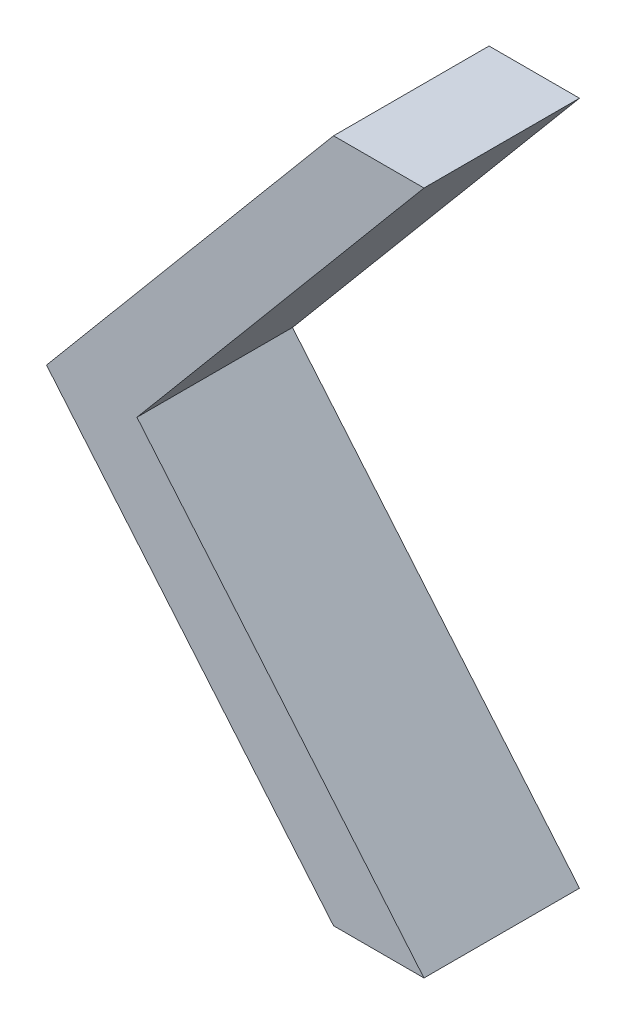
ISO-10303-21;
HEADER;
FILE_DESCRIPTION(('STEP AP214'),'2;1');
FILE_NAME('part.step','',(''),(''),'','','');
FILE_SCHEMA(('AUTOMOTIVE_DESIGN { 1 0 10303 214 1 1 1 1 }'));
ENDSEC;
DATA;
#1=APPLICATION_CONTEXT('core data for automotive mechanical design processes');
#2=APPLICATION_PROTOCOL_DEFINITION('international standard','automotive_design',2000,#1);
#3=PRODUCT_CONTEXT('',#1,'mechanical');
#4=PRODUCT('Part','Part','',(#3));
#5=PRODUCT_RELATED_PRODUCT_CATEGORY('part','',(#4));
#6=PRODUCT_DEFINITION_FORMATION('','',#4);
#7=PRODUCT_DEFINITION_CONTEXT('part definition',#1,'design');
#8=PRODUCT_DEFINITION('design','',#6,#7);
#9=PRODUCT_DEFINITION_SHAPE('','',#8);
#10=(LENGTH_UNIT() NAMED_UNIT(*) SI_UNIT(.MILLI.,.METRE.));
#11=(NAMED_UNIT(*) PLANE_ANGLE_UNIT() SI_UNIT($,.RADIAN.));
#12=(NAMED_UNIT(*) SI_UNIT($,.STERADIAN.) SOLID_ANGLE_UNIT());
#13=UNCERTAINTY_MEASURE_WITH_UNIT(LENGTH_MEASURE(1.E-05),#10,'distance_accuracy_value','');
#14=(GEOMETRIC_REPRESENTATION_CONTEXT(3) GLOBAL_UNCERTAINTY_ASSIGNED_CONTEXT((#13)) GLOBAL_UNIT_ASSIGNED_CONTEXT((#10,
#11,#12)) REPRESENTATION_CONTEXT('',''));
#15=CARTESIAN_POINT('',(0.,0.,0.));
#16=DIRECTION('',(0.,0.,1.));
#17=DIRECTION('',(1.,0.,0.));
#18=AXIS2_PLACEMENT_3D('',#15,#16,#17);
#19=CARTESIAN_POINT('',(0.,0.,12.5));
#20=DIRECTION('',(0.,-1.,0.));
#21=DIRECTION('',(0.,0.,-1.));
#22=AXIS2_PLACEMENT_3D('',#19,#20,#21);
#23=PLANE('',#22);
#24=DIRECTION('',(-1.,0.,0.));
#25=VECTOR('',#24,1.);
#26=CARTESIAN_POINT('',(0.,0.,0.));
#27=LINE('',#26,#25);
#28=CARTESIAN_POINT('',(7.27,0.,0.));
#29=VERTEX_POINT('',#28);
#30=CARTESIAN_POINT('',(0.,0.,0.));
#31=VERTEX_POINT('',#30);
#32=EDGE_CURVE('E128',#29,#31,#27,.T.);
#33=ORIENTED_EDGE('',*,*,#32,.T.);
#34=DIRECTION('',(0.,0.,-1.));
#35=VECTOR('',#34,1.);
#36=CARTESIAN_POINT('',(0.,0.,12.5));
#37=LINE('',#36,#35);
#38=CARTESIAN_POINT('',(0.,0.,12.5));
#39=VERTEX_POINT('',#38);
#40=EDGE_CURVE('E11',#39,#31,#37,.T.);
#41=ORIENTED_EDGE('',*,*,#40,.F.);
#42=DIRECTION('',(-1.,0.,0.));
#43=VECTOR('',#42,1.);
#44=CARTESIAN_POINT('',(0.,0.,12.5));
#45=LINE('',#44,#43);
#46=CARTESIAN_POINT('',(7.27,0.,12.5));
#47=VERTEX_POINT('',#46);
#48=EDGE_CURVE('E144',#47,#39,#45,.T.);
#49=ORIENTED_EDGE('',*,*,#48,.F.);
#50=DIRECTION('',(0.,0.,-1.));
#51=VECTOR('',#50,1.);
#52=CARTESIAN_POINT('',(7.27,0.,12.5));
#53=LINE('',#52,#51);
#54=EDGE_CURVE('E124',#47,#29,#53,.T.);
#55=ORIENTED_EDGE('',*,*,#54,.T.);
#56=EDGE_LOOP('',(#33,#41,#49,#55));
#57=FACE_BOUND('',#56,.T.);
#58=ADVANCED_FACE('F39',(#57),#23,.F.);
#59=CARTESIAN_POINT('',(0.,0.,12.5));
#60=DIRECTION('',(0.766044443118977,-0.642787609686541,0.));
#61=DIRECTION('',(0.642787609686541,0.766044443118977,0.));
#62=AXIS2_PLACEMENT_3D('',#59,#60,#61);
#63=PLANE('',#62);
#64=DIRECTION('',(-0.642787609686541,-0.766044443118977,0.));
#65=VECTOR('',#64,1.);
#66=CARTESIAN_POINT('',(0.,0.,0.));
#67=LINE('',#66,#65);
#68=CARTESIAN_POINT('',(-23.0752398573753,-27.5,0.));
#69=VERTEX_POINT('',#68);
#70=EDGE_CURVE('E132',#31,#69,#67,.T.);
#71=ORIENTED_EDGE('',*,*,#70,.T.);
#72=DIRECTION('',(0.,0.,-1.));
#73=VECTOR('',#72,1.);
#74=CARTESIAN_POINT('',(-23.0752398573753,-27.5,12.5));
#75=LINE('',#74,#73);
#76=CARTESIAN_POINT('',(-23.0752398573753,-27.5,12.5));
#77=VERTEX_POINT('',#76);
#78=EDGE_CURVE('E48',#77,#69,#75,.T.);
#79=ORIENTED_EDGE('',*,*,#78,.F.);
#80=DIRECTION('',(-0.642787609686541,-0.766044443118977,0.));
#81=VECTOR('',#80,1.);
#82=CARTESIAN_POINT('',(0.,0.,12.5));
#83=LINE('',#82,#81);
#84=EDGE_CURVE('E93',#39,#77,#83,.T.);
#85=ORIENTED_EDGE('',*,*,#84,.F.);
#86=ORIENTED_EDGE('',*,*,#40,.T.);
#87=EDGE_LOOP('',(#71,#79,#85,#86));
#88=FACE_BOUND('',#87,.T.);
#89=ADVANCED_FACE('F172',(#88),#63,.F.);
#90=CARTESIAN_POINT('',(-23.0752398573753,-27.5,12.5));
#91=DIRECTION('',(0.766044443118977,0.64278760968654,0.));
#92=DIRECTION('',(-0.64278760968654,0.766044443118977,0.));
#93=AXIS2_PLACEMENT_3D('',#90,#91,#92);
#94=PLANE('',#93);
#95=DIRECTION('',(0.64278760968654,-0.766044443118977,0.));
#96=VECTOR('',#95,1.);
#97=CARTESIAN_POINT('',(-23.0752398573753,-27.5,0.));
#98=LINE('',#97,#96);
#99=CARTESIAN_POINT('',(0.,-55.,0.));
#100=VERTEX_POINT('',#99);
#101=EDGE_CURVE('E135',#69,#100,#98,.T.);
#102=ORIENTED_EDGE('',*,*,#101,.T.);
#103=DIRECTION('',(0.,0.,-1.));
#104=VECTOR('',#103,1.);
#105=CARTESIAN_POINT('',(0.,-55.,12.5));
#106=LINE('',#105,#104);
#107=CARTESIAN_POINT('',(0.,-55.,12.5));
#108=VERTEX_POINT('',#107);
#109=EDGE_CURVE('E117',#108,#100,#106,.T.);
#110=ORIENTED_EDGE('',*,*,#109,.F.);
#111=DIRECTION('',(0.64278760968654,-0.766044443118977,0.));
#112=VECTOR('',#111,1.);
#113=CARTESIAN_POINT('',(-23.0752398573753,-27.5,12.5));
#114=LINE('',#113,#112);
#115=EDGE_CURVE('E106',#77,#108,#114,.T.);
#116=ORIENTED_EDGE('',*,*,#115,.F.);
#117=ORIENTED_EDGE('',*,*,#78,.T.);
#118=EDGE_LOOP('',(#102,#110,#116,#117));
#119=FACE_BOUND('',#118,.T.);
#120=ADVANCED_FACE('F154',(#119),#94,.F.);
#121=CARTESIAN_POINT('',(0.,-55.,12.5));
#122=DIRECTION('',(0.,1.,0.));
#123=DIRECTION('',(0.,0.,1.));
#124=AXIS2_PLACEMENT_3D('',#121,#122,#123);
#125=PLANE('',#124);
#126=DIRECTION('',(1.,0.,0.));
#127=VECTOR('',#126,1.);
#128=CARTESIAN_POINT('',(0.,-55.,0.));
#129=LINE('',#128,#127);
#130=CARTESIAN_POINT('',(7.26999999999999,-55.,0.));
#131=VERTEX_POINT('',#130);
#132=EDGE_CURVE('E115',#100,#131,#129,.T.);
#133=ORIENTED_EDGE('',*,*,#132,.T.);
#134=DIRECTION('',(0.,0.,-1.));
#135=VECTOR('',#134,1.);
#136=CARTESIAN_POINT('',(7.26999999999999,-55.,12.5));
#137=LINE('',#136,#135);
#138=CARTESIAN_POINT('',(7.26999999999999,-55.,12.5));
#139=VERTEX_POINT('',#138);
#140=EDGE_CURVE('E112',#139,#131,#137,.T.);
#141=ORIENTED_EDGE('',*,*,#140,.F.);
#142=DIRECTION('',(1.,0.,0.));
#143=VECTOR('',#142,1.);
#144=CARTESIAN_POINT('',(0.,-55.,12.5));
#145=LINE('',#144,#143);
#146=EDGE_CURVE('E100',#108,#139,#145,.T.);
#147=ORIENTED_EDGE('',*,*,#146,.F.);
#148=ORIENTED_EDGE('',*,*,#109,.T.);
#149=EDGE_LOOP('',(#133,#141,#147,#148));
#150=FACE_BOUND('',#149,.T.);
#151=ADVANCED_FACE('F113',(#150),#125,.F.);
#152=CARTESIAN_POINT('',(-15.8052398573753,-27.5,12.5));
#153=DIRECTION('',(-0.766044443118977,-0.64278760968654,0.));
#154=DIRECTION('',(0.64278760968654,-0.766044443118977,0.));
#155=AXIS2_PLACEMENT_3D('',#152,#153,#154);
#156=PLANE('',#155);
#157=DIRECTION('',(-0.64278760968654,0.766044443118977,0.));
#158=VECTOR('',#157,1.);
#159=CARTESIAN_POINT('',(-15.8052398573753,-27.5,0.));
#160=LINE('',#159,#158);
#161=CARTESIAN_POINT('',(-15.8052398573753,-27.5,0.));
#162=VERTEX_POINT('',#161);
#163=EDGE_CURVE('E79',#131,#162,#160,.T.);
#164=ORIENTED_EDGE('',*,*,#163,.T.);
#165=DIRECTION('',(0.,0.,-1.));
#166=VECTOR('',#165,1.);
#167=CARTESIAN_POINT('',(-15.8052398573753,-27.5,12.5));
#168=LINE('',#167,#166);
#169=CARTESIAN_POINT('',(-15.8052398573753,-27.5,12.5));
#170=VERTEX_POINT('',#169);
#171=EDGE_CURVE('E118',#170,#162,#168,.T.);
#172=ORIENTED_EDGE('',*,*,#171,.F.);
#173=DIRECTION('',(-0.64278760968654,0.766044443118977,0.));
#174=VECTOR('',#173,1.);
#175=CARTESIAN_POINT('',(-15.8052398573753,-27.5,12.5));
#176=LINE('',#175,#174);
#177=EDGE_CURVE('E104',#139,#170,#176,.T.);
#178=ORIENTED_EDGE('',*,*,#177,.F.);
#179=ORIENTED_EDGE('',*,*,#140,.T.);
#180=EDGE_LOOP('',(#164,#172,#178,#179));
#181=FACE_BOUND('',#180,.T.);
#182=ADVANCED_FACE('F120',(#181),#156,.F.);
#183=CARTESIAN_POINT('',(7.27,0.,12.5));
#184=DIRECTION('',(-0.766044443118977,0.642787609686541,0.));
#185=DIRECTION('',(-0.642787609686541,-0.766044443118977,0.));
#186=AXIS2_PLACEMENT_3D('',#183,#184,#185);
#187=PLANE('',#186);
#188=DIRECTION('',(0.642787609686541,0.766044443118977,0.));
#189=VECTOR('',#188,1.);
#190=CARTESIAN_POINT('',(7.27,0.,0.));
#191=LINE('',#190,#189);
#192=EDGE_CURVE('E85',#162,#29,#191,.T.);
#193=ORIENTED_EDGE('',*,*,#192,.T.);
#194=ORIENTED_EDGE('',*,*,#54,.F.);
#195=DIRECTION('',(0.642787609686541,0.766044443118977,0.));
#196=VECTOR('',#195,1.);
#197=CARTESIAN_POINT('',(7.27,0.,12.5));
#198=LINE('',#197,#196);
#199=EDGE_CURVE('E56',#170,#47,#198,.T.);
#200=ORIENTED_EDGE('',*,*,#199,.F.);
#201=ORIENTED_EDGE('',*,*,#171,.T.);
#202=EDGE_LOOP('',(#193,#194,#200,#201));
#203=FACE_BOUND('',#202,.T.);
#204=ADVANCED_FACE('F161',(#203),#187,.F.);
#205=CARTESIAN_POINT('',(0.,0.,12.5));
#206=DIRECTION('',(0.,0.,-1.));
#207=DIRECTION('',(-1.,0.,0.));
#208=AXIS2_PLACEMENT_3D('',#205,#206,#207);
#209=PLANE('',#208);
#210=ORIENTED_EDGE('',*,*,#48,.T.);
#211=ORIENTED_EDGE('',*,*,#84,.T.);
#212=ORIENTED_EDGE('',*,*,#115,.T.);
#213=ORIENTED_EDGE('',*,*,#146,.T.);
#214=ORIENTED_EDGE('',*,*,#177,.T.);
#215=ORIENTED_EDGE('',*,*,#199,.T.);
#216=EDGE_LOOP('',(#210,#211,#212,#213,#214,#215));
#217=FACE_BOUND('',#216,.T.);
#218=ADVANCED_FACE('F102',(#217),#209,.F.);
#219=CARTESIAN_POINT('',(0.,0.,0.));
#220=DIRECTION('',(0.,0.,-1.));
#221=DIRECTION('',(-1.,0.,0.));
#222=AXIS2_PLACEMENT_3D('',#219,#220,#221);
#223=PLANE('',#222);
#224=ORIENTED_EDGE('',*,*,#32,.F.);
#225=ORIENTED_EDGE('',*,*,#192,.F.);
#226=ORIENTED_EDGE('',*,*,#163,.F.);
#227=ORIENTED_EDGE('',*,*,#132,.F.);
#228=ORIENTED_EDGE('',*,*,#101,.F.);
#229=ORIENTED_EDGE('',*,*,#70,.F.);
#230=EDGE_LOOP('',(#224,#225,#226,#227,#228,#229));
#231=FACE_BOUND('',#230,.T.);
#232=ADVANCED_FACE('F157',(#231),#223,.T.);
#233=CLOSED_SHELL('',(#58,#89,#120,#151,#182,#204,#218,#232));
#234=MANIFOLD_SOLID_BREP('B2',#233);
#235=ADVANCED_BREP_SHAPE_REPRESENTATION('',(#18,#234),#14);
#236=SHAPE_DEFINITION_REPRESENTATION(#9,#235);
ENDSEC;
END-ISO-10303-21;
